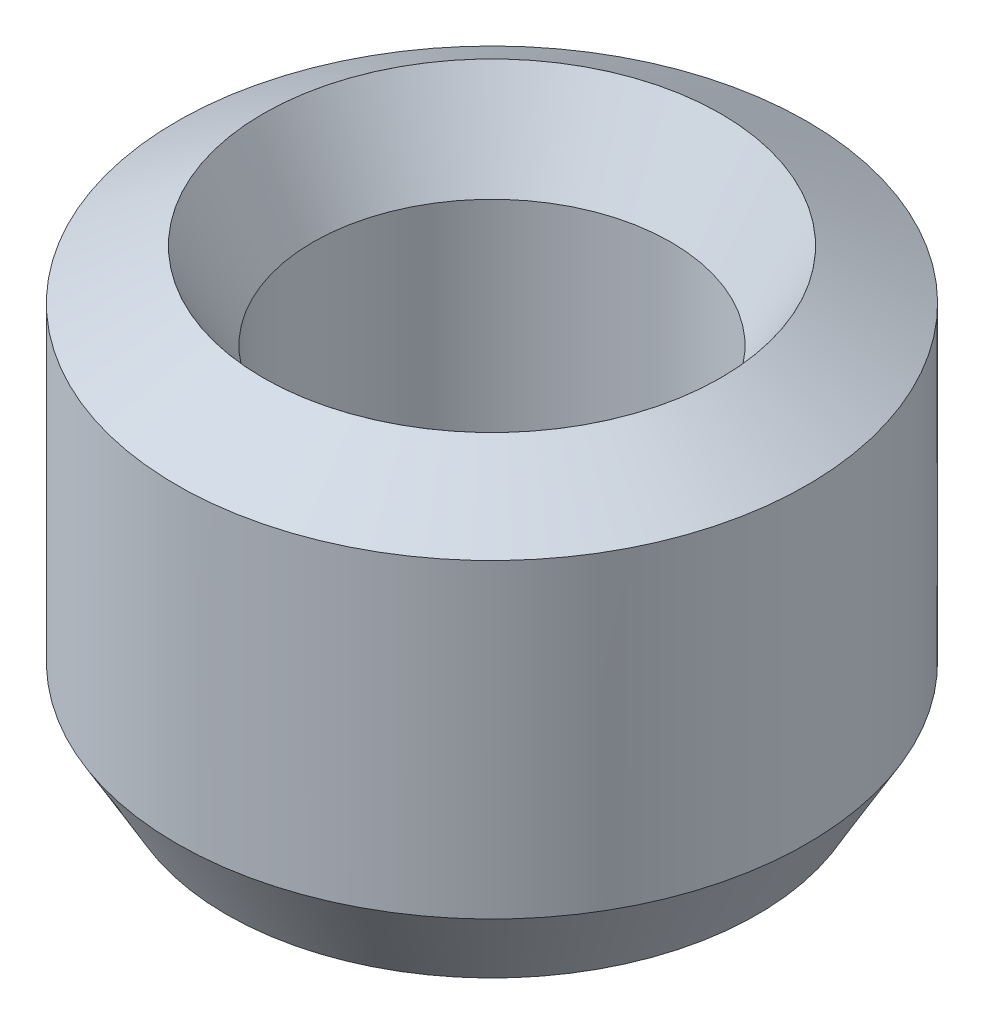
ISO-10303-21;
HEADER;
FILE_DESCRIPTION(('STEP AP214'),'2;1');
FILE_NAME('part.step','',(''),(''),'','','');
FILE_SCHEMA(('AUTOMOTIVE_DESIGN { 1 0 10303 214 1 1 1 1 }'));
ENDSEC;
DATA;
#1=APPLICATION_CONTEXT('core data for automotive mechanical design processes');
#2=APPLICATION_PROTOCOL_DEFINITION('international standard','automotive_design',2000,#1);
#3=PRODUCT_CONTEXT('',#1,'mechanical');
#4=PRODUCT('Part','Part','',(#3));
#5=PRODUCT_RELATED_PRODUCT_CATEGORY('part','',(#4));
#6=PRODUCT_DEFINITION_FORMATION('','',#4);
#7=PRODUCT_DEFINITION_CONTEXT('part definition',#1,'design');
#8=PRODUCT_DEFINITION('design','',#6,#7);
#9=PRODUCT_DEFINITION_SHAPE('','',#8);
#10=(LENGTH_UNIT() NAMED_UNIT(*) SI_UNIT(.MILLI.,.METRE.));
#11=(NAMED_UNIT(*) PLANE_ANGLE_UNIT() SI_UNIT($,.RADIAN.));
#12=(NAMED_UNIT(*) SI_UNIT($,.STERADIAN.) SOLID_ANGLE_UNIT());
#13=UNCERTAINTY_MEASURE_WITH_UNIT(LENGTH_MEASURE(1.E-05),#10,'distance_accuracy_value','');
#14=(GEOMETRIC_REPRESENTATION_CONTEXT(3) GLOBAL_UNCERTAINTY_ASSIGNED_CONTEXT((#13)) GLOBAL_UNIT_ASSIGNED_CONTEXT((#10,
#11,#12)) REPRESENTATION_CONTEXT('',''));
#15=CARTESIAN_POINT('',(0.,0.,0.));
#16=DIRECTION('',(0.,0.,1.));
#17=DIRECTION('',(1.,0.,0.));
#18=AXIS2_PLACEMENT_3D('',#15,#16,#17);
#19=CARTESIAN_POINT('',(0.,35.430724015313,0.));
#20=DIRECTION('',(0.,-1.,0.));
#21=DIRECTION('',(0.,0.,-1.));
#22=AXIS2_PLACEMENT_3D('',#19,#20,#21);
#23=CYLINDRICAL_SURFACE('',#22,25.);
#24=CARTESIAN_POINT('',(0.,6.84608260738762,0.));
#25=DIRECTION('',(0.,1.,0.));
#26=DIRECTION('',(0.,0.,1.));
#27=AXIS2_PLACEMENT_3D('',#24,#25,#26);
#28=CIRCLE('',#27,25.);
#29=CARTESIAN_POINT('',(0.,6.84608260738762,-25.));
#30=VERTEX_POINT('',#29);
#31=EDGE_CURVE('E10',#30,#30,#28,.T.);
#32=CARTESIAN_POINT('',(0.,31.4781363790434,0.));
#33=DIRECTION('',(0.,1.,0.));
#34=DIRECTION('',(0.,0.,1.));
#35=AXIS2_PLACEMENT_3D('',#32,#33,#34);
#36=CIRCLE('',#35,25.);
#37=CARTESIAN_POINT('',(0.,31.4781363790434,-25.));
#38=VERTEX_POINT('',#37);
#39=EDGE_CURVE('E50',#38,#38,#36,.F.);
#40=CARTESIAN_POINT('',(0.,6.84608260738762,-25.));
#41=CARTESIAN_POINT('',(0.,7.10266650084237,-25.));
#42=CARTESIAN_POINT('',(0.,7.35925039429711,-25.));
#43=CARTESIAN_POINT('',(0.,7.87241818120661,-25.));
#44=CARTESIAN_POINT('',(0.,8.12900207466136,-25.));
#45=CARTESIAN_POINT('',(0.,8.64216986157085,-25.));
#46=CARTESIAN_POINT('',(0.,8.8987537550256,-25.));
#47=CARTESIAN_POINT('',(0.,9.4119215419351,-25.));
#48=CARTESIAN_POINT('',(0.,9.66850543538984,-25.));
#49=CARTESIAN_POINT('',(0.,10.1816732222993,-25.));
#50=CARTESIAN_POINT('',(0.,10.4382571157541,-25.));
#51=CARTESIAN_POINT('',(0.,10.9514249026636,-25.));
#52=CARTESIAN_POINT('',(0.,11.2080087961183,-25.));
#53=CARTESIAN_POINT('',(0.,11.7211765830278,-25.));
#54=CARTESIAN_POINT('',(0.,11.9777604764826,-25.));
#55=CARTESIAN_POINT('',(0.,12.4909282633921,-25.));
#56=CARTESIAN_POINT('',(0.,12.7475121568468,-25.));
#57=CARTESIAN_POINT('',(0.,13.2606799437563,-25.));
#58=CARTESIAN_POINT('',(0.,13.5172638372111,-25.));
#59=CARTESIAN_POINT('',(0.,14.0304316241205,-25.));
#60=CARTESIAN_POINT('',(0.,14.2870155175753,-25.));
#61=CARTESIAN_POINT('',(0.,14.8001833044848,-25.));
#62=CARTESIAN_POINT('',(0.,15.0567671979395,-25.));
#63=CARTESIAN_POINT('',(0.,15.569934984849,-25.));
#64=CARTESIAN_POINT('',(0.,15.8265188783038,-25.));
#65=CARTESIAN_POINT('',(0.,16.3396866652133,-25.));
#66=CARTESIAN_POINT('',(0.,16.596270558668,-25.));
#67=CARTESIAN_POINT('',(0.,17.1094383455775,-25.));
#68=CARTESIAN_POINT('',(0.,17.3660222390323,-25.));
#69=CARTESIAN_POINT('',(0.,17.8791900259418,-25.));
#70=CARTESIAN_POINT('',(0.,18.1357739193965,-25.));
#71=CARTESIAN_POINT('',(0.,18.648941706306,-25.));
#72=CARTESIAN_POINT('',(0.,18.9055255997608,-25.));
#73=CARTESIAN_POINT('',(0.,19.4186933866702,-25.));
#74=CARTESIAN_POINT('',(0.,19.675277280125,-25.));
#75=CARTESIAN_POINT('',(0.,20.1884450670345,-25.));
#76=CARTESIAN_POINT('',(0.,20.4450289604892,-25.));
#77=CARTESIAN_POINT('',(0.,20.9581967473987,-25.));
#78=CARTESIAN_POINT('',(0.,21.2147806408535,-25.));
#79=CARTESIAN_POINT('',(0.,21.727948427763,-25.));
#80=CARTESIAN_POINT('',(0.,21.9845323212177,-25.));
#81=CARTESIAN_POINT('',(0.,22.4977001081272,-25.));
#82=CARTESIAN_POINT('',(0.,22.754284001582,-25.));
#83=CARTESIAN_POINT('',(0.,23.2674517884915,-25.));
#84=CARTESIAN_POINT('',(0.,23.5240356819462,-25.));
#85=CARTESIAN_POINT('',(0.,24.0372034688557,-25.));
#86=CARTESIAN_POINT('',(0.,24.2937873623104,-25.));
#87=CARTESIAN_POINT('',(0.,24.8069551492199,-25.));
#88=CARTESIAN_POINT('',(0.,25.0635390426747,-25.));
#89=CARTESIAN_POINT('',(0.,25.5767068295842,-25.));
#90=CARTESIAN_POINT('',(0.,25.8332907230389,-25.));
#91=CARTESIAN_POINT('',(0.,26.3464585099484,-25.));
#92=CARTESIAN_POINT('',(0.,26.6030424034032,-25.));
#93=CARTESIAN_POINT('',(0.,27.1162101903127,-25.));
#94=CARTESIAN_POINT('',(0.,27.3727940837674,-25.));
#95=CARTESIAN_POINT('',(0.,27.8859618706769,-25.));
#96=CARTESIAN_POINT('',(0.,28.1425457641317,-25.));
#97=CARTESIAN_POINT('',(0.,28.6557135510412,-25.));
#98=CARTESIAN_POINT('',(0.,28.9122974444959,-25.));
#99=CARTESIAN_POINT('',(0.,29.4254652314054,-25.));
#100=CARTESIAN_POINT('',(0.,29.6820491248601,-25.));
#101=CARTESIAN_POINT('',(0.,30.1952169117696,-25.));
#102=CARTESIAN_POINT('',(0.,30.4518008052244,-25.));
#103=CARTESIAN_POINT('',(0.,30.9649685921339,-25.));
#104=CARTESIAN_POINT('',(0.,31.2215524855886,-25.));
#105=CARTESIAN_POINT('',(0.,31.4781363790434,-25.));
#106=B_SPLINE_CURVE_WITH_KNOTS('',3,(#40,#41,#42,#43,#44,#45,#46,#47,#48,#49,#50,#51,#52,#53,
#54,#55,#56,#57,#58,#59,#60,#61,#62,#63,#64,#65,#66,#67,#68,#69,#70,#71,#72,#73,#74,#75,#76,#77,
#78,#79,#80,#81,#82,#83,#84,#85,#86,#87,#88,#89,#90,#91,#92,#93,#94,#95,#96,#97,#98,#99,#100,
#101,#102,#103,#104,#105),.UNSPECIFIED.,.F.,.F.,(4,2,2,2,2,2,2,2,2,2,2,2,2,2,2,2,2,2,2,2,2,2,2,
2,2,2,2,2,2,2,2,2,4),(0.,0.769751680364243,1.53950336072849,2.30925504109273,3.07900672145697,
3.84875840182121,4.61851008218546,5.3882617625497,6.15801344291394,6.92776512327818,
7.69751680364242,8.46726848400667,9.23702016437091,10.0067718447352,10.7765235250994,
11.5462752054636,12.3160268858279,13.0857785661921,13.8555302465564,14.6252819269206,
15.3950336072848,16.1647852876491,16.9345369680133,17.7042886483776,18.4740403287418,
19.2437920091061,20.0135436894703,20.7832953698345,21.5530470501988,22.322798730563,
23.0925504109273,23.8623020912915,24.6320537716558),.UNSPECIFIED.);
#107=EDGE_CURVE('BSEAM39',#30,#38,#106,.T.);
#108=ORIENTED_EDGE('',*,*,#31,.T.);
#109=ORIENTED_EDGE('',*,*,#39,.T.);
#110=ORIENTED_EDGE('',*,*,#107,.T.);
#111=ORIENTED_EDGE('',*,*,#107,.F.);
#112=EDGE_LOOP('',(#108,#110,#109,#111));
#113=FACE_BOUND('',#112,.T.);
#114=ADVANCED_FACE('F39',(#113),#23,.T.);
#115=CARTESIAN_POINT('',(0.,35.430724015313,0.));
#116=DIRECTION('',(0.,1.,0.));
#117=DIRECTION('',(0.,0.,1.));
#118=AXIS2_PLACEMENT_3D('',#115,#116,#117);
#119=PLANE('',#118);
#120=CARTESIAN_POINT('',(0.,35.430724015313,0.));
#121=DIRECTION('',(0.,1.,0.));
#122=DIRECTION('',(0.,0.,1.));
#123=AXIS2_PLACEMENT_3D('',#120,#121,#122);
#124=CIRCLE('',#123,18.1517224325015);
#125=CARTESIAN_POINT('',(0.,35.430724015313,18.1517224325015));
#126=VERTEX_POINT('',#125);
#127=EDGE_CURVE('E58',#126,#126,#124,.F.);
#128=ORIENTED_EDGE('',*,*,#127,.T.);
#129=EDGE_LOOP('',(#128));
#130=FACE_BOUND('',#129,.T.);
#131=CARTESIAN_POINT('',(0.,35.430724015313,0.));
#132=DIRECTION('',(0.,1.,0.));
#133=DIRECTION('',(0.,0.,1.));
#134=AXIS2_PLACEMENT_3D('',#131,#132,#133);
#135=CIRCLE('',#134,18.1539173926125);
#136=CARTESIAN_POINT('',(0.,35.430724015313,18.1539173926125));
#137=VERTEX_POINT('',#136);
#138=EDGE_CURVE('E61',#137,#137,#135,.T.);
#139=ORIENTED_EDGE('',*,*,#138,.T.);
#140=EDGE_LOOP('',(#139));
#141=FACE_BOUND('',#140,.T.);
#142=ADVANCED_FACE('F88',(#130,#141),#119,.T.);
#143=CARTESIAN_POINT('',(0.,0.,0.));
#144=DIRECTION('',(0.,1.,0.));
#145=DIRECTION('',(0.,0.,1.));
#146=AXIS2_PLACEMENT_3D('',#143,#144,#145);
#147=PLANE('',#146);
#148=CARTESIAN_POINT('',(0.,0.,0.));
#149=DIRECTION('',(0.,1.,0.));
#150=DIRECTION('',(0.,0.,1.));
#151=AXIS2_PLACEMENT_3D('',#148,#149,#150);
#152=CIRCLE('',#151,21.0452174036193);
#153=CARTESIAN_POINT('',(0.,0.,21.0452174036193));
#154=VERTEX_POINT('',#153);
#155=EDGE_CURVE('E51',#154,#154,#152,.T.);
#156=ORIENTED_EDGE('',*,*,#155,.T.);
#157=EDGE_LOOP('',(#156));
#158=FACE_BOUND('',#157,.T.);
#159=CARTESIAN_POINT('',(0.,0.,0.));
#160=DIRECTION('',(0.,1.,0.));
#161=DIRECTION('',(0.,0.,1.));
#162=AXIS2_PLACEMENT_3D('',#159,#160,#161);
#163=CIRCLE('',#162,21.0474123637303);
#164=CARTESIAN_POINT('',(0.,0.,21.0474123637303));
#165=VERTEX_POINT('',#164);
#166=EDGE_CURVE('E54',#165,#165,#163,.F.);
#167=ORIENTED_EDGE('',*,*,#166,.T.);
#168=EDGE_LOOP('',(#167));
#169=FACE_BOUND('',#168,.T.);
#170=ADVANCED_FACE('F83',(#158,#169),#147,.F.);
#171=CARTESIAN_POINT('',(0.,35.430724015313,0.));
#172=DIRECTION('',(0.,-1.,0.));
#173=DIRECTION('',(0.,0.,-1.));
#174=AXIS2_PLACEMENT_3D('',#171,#172,#173);
#175=CYLINDRICAL_SURFACE('',#174,14.1991347962318);
#176=CARTESIAN_POINT('',(0.,28.5846414079254,0.));
#177=DIRECTION('',(0.,1.,0.));
#178=DIRECTION('',(0.,0.,1.));
#179=AXIS2_PLACEMENT_3D('',#176,#177,#178);
#180=CIRCLE('',#179,14.1991347962318);
#181=CARTESIAN_POINT('',(0.,28.5846414079254,-14.1991347962318));
#182=VERTEX_POINT('',#181);
#183=EDGE_CURVE('E67',#182,#182,#180,.T.);
#184=CARTESIAN_POINT('',(0.,3.95258763626964,0.));
#185=DIRECTION('',(0.,1.,0.));
#186=DIRECTION('',(0.,0.,1.));
#187=AXIS2_PLACEMENT_3D('',#184,#185,#186);
#188=CIRCLE('',#187,14.1991347962318);
#189=CARTESIAN_POINT('',(0.,3.95258763626964,-14.1991347962318));
#190=VERTEX_POINT('',#189);
#191=EDGE_CURVE('E69',#190,#190,#188,.F.);
#192=CARTESIAN_POINT('',(0.,28.5846414079254,-14.1991347962318));
#193=CARTESIAN_POINT('',(0.,28.3280575144706,-14.1991347962318));
#194=CARTESIAN_POINT('',(0.,28.0714736210159,-14.1991347962318));
#195=CARTESIAN_POINT('',(0.,27.5583058341064,-14.1991347962318));
#196=CARTESIAN_POINT('',(0.,27.3017219406516,-14.1991347962318));
#197=CARTESIAN_POINT('',(0.,26.7885541537421,-14.1991347962318));
#198=CARTESIAN_POINT('',(0.,26.5319702602874,-14.1991347962318));
#199=CARTESIAN_POINT('',(0.,26.0188024733779,-14.1991347962318));
#200=CARTESIAN_POINT('',(0.,25.7622185799231,-14.1991347962318));
#201=CARTESIAN_POINT('',(0.,25.2490507930137,-14.1991347962318));
#202=CARTESIAN_POINT('',(0.,24.9924668995589,-14.1991347962318));
#203=CARTESIAN_POINT('',(0.,24.4792991126494,-14.1991347962318));
#204=CARTESIAN_POINT('',(0.,24.2227152191947,-14.1991347962318));
#205=CARTESIAN_POINT('',(0.,23.7095474322852,-14.1991347962318));
#206=CARTESIAN_POINT('',(0.,23.4529635388304,-14.1991347962318));
#207=CARTESIAN_POINT('',(0.,22.9397957519209,-14.1991347962318));
#208=CARTESIAN_POINT('',(0.,22.6832118584662,-14.1991347962318));
#209=CARTESIAN_POINT('',(0.,22.1700440715567,-14.1991347962318));
#210=CARTESIAN_POINT('',(0.,21.9134601781019,-14.1991347962318));
#211=CARTESIAN_POINT('',(0.,21.4002923911924,-14.1991347962318));
#212=CARTESIAN_POINT('',(0.,21.1437084977377,-14.1991347962318));
#213=CARTESIAN_POINT('',(0.,20.6305407108282,-14.1991347962318));
#214=CARTESIAN_POINT('',(0.,20.3739568173735,-14.1991347962318));
#215=CARTESIAN_POINT('',(0.,19.860789030464,-14.1991347962318));
#216=CARTESIAN_POINT('',(0.,19.6042051370092,-14.1991347962318));
#217=CARTESIAN_POINT('',(0.,19.0910373500997,-14.1991347962318));
#218=CARTESIAN_POINT('',(0.,18.834453456645,-14.1991347962318));
#219=CARTESIAN_POINT('',(0.,18.3212856697355,-14.1991347962318));
#220=CARTESIAN_POINT('',(0.,18.0647017762807,-14.1991347962318));
#221=CARTESIAN_POINT('',(0.,17.5515339893712,-14.1991347962318));
#222=CARTESIAN_POINT('',(0.,17.2949500959165,-14.1991347962318));
#223=CARTESIAN_POINT('',(0.,16.781782309007,-14.1991347962318));
#224=CARTESIAN_POINT('',(0.,16.5251984155522,-14.1991347962318));
#225=CARTESIAN_POINT('',(0.,16.0120306286428,-14.1991347962318));
#226=CARTESIAN_POINT('',(0.,15.755446735188,-14.1991347962318));
#227=CARTESIAN_POINT('',(0.,15.2422789482785,-14.1991347962318));
#228=CARTESIAN_POINT('',(0.,14.9856950548238,-14.1991347962318));
#229=CARTESIAN_POINT('',(0.,14.4725272679143,-14.1991347962318));
#230=CARTESIAN_POINT('',(0.,14.2159433744595,-14.1991347962318));
#231=CARTESIAN_POINT('',(0.,13.70277558755,-14.1991347962318));
#232=CARTESIAN_POINT('',(0.,13.4461916940953,-14.1991347962318));
#233=CARTESIAN_POINT('',(0.,12.9330239071858,-14.1991347962318));
#234=CARTESIAN_POINT('',(0.,12.676440013731,-14.1991347962318));
#235=CARTESIAN_POINT('',(0.,12.1632722268215,-14.1991347962318));
#236=CARTESIAN_POINT('',(0.,11.9066883333668,-14.1991347962318));
#237=CARTESIAN_POINT('',(0.,11.3935205464573,-14.1991347962318));
#238=CARTESIAN_POINT('',(0.,11.1369366530026,-14.1991347962318));
#239=CARTESIAN_POINT('',(0.,10.6237688660931,-14.1991347962318));
#240=CARTESIAN_POINT('',(0.,10.3671849726383,-14.1991347962318));
#241=CARTESIAN_POINT('',(0.,9.85401718572882,-14.1991347962318));
#242=CARTESIAN_POINT('',(0.,9.59743329227408,-14.1991347962318));
#243=CARTESIAN_POINT('',(0.,9.08426550536458,-14.1991347962318));
#244=CARTESIAN_POINT('',(0.,8.82768161190983,-14.1991347962318));
#245=CARTESIAN_POINT('',(0.,8.31451382500034,-14.1991347962318));
#246=CARTESIAN_POINT('',(0.,8.05792993154559,-14.1991347962318));
#247=CARTESIAN_POINT('',(0.,7.5447621446361,-14.1991347962318));
#248=CARTESIAN_POINT('',(0.,7.28817825118135,-14.1991347962318));
#249=CARTESIAN_POINT('',(0.,6.77501046427186,-14.1991347962318));
#250=CARTESIAN_POINT('',(0.,6.51842657081711,-14.1991347962318));
#251=CARTESIAN_POINT('',(0.,6.00525878390762,-14.1991347962318));
#252=CARTESIAN_POINT('',(0.,5.74867489045287,-14.1991347962318));
#253=CARTESIAN_POINT('',(0.,5.23550710354337,-14.1991347962318));
#254=CARTESIAN_POINT('',(0.,4.97892321008863,-14.1991347962318));
#255=CARTESIAN_POINT('',(0.,4.46575542317913,-14.1991347962318));
#256=CARTESIAN_POINT('',(0.,4.20917152972439,-14.1991347962318));
#257=CARTESIAN_POINT('',(0.,3.95258763626964,-14.1991347962318));
#258=B_SPLINE_CURVE_WITH_KNOTS('',3,(#192,#193,#194,#195,#196,#197,#198,#199,#200,#201,#202,
#203,#204,#205,#206,#207,#208,#209,#210,#211,#212,#213,#214,#215,#216,#217,#218,#219,#220,#221,
#222,#223,#224,#225,#226,#227,#228,#229,#230,#231,#232,#233,#234,#235,#236,#237,#238,#239,#240,
#241,#242,#243,#244,#245,#246,#247,#248,#249,#250,#251,#252,#253,#254,#255,#256,#257),
.UNSPECIFIED.,.F.,.F.,(4,2,2,2,2,2,2,2,2,2,2,2,2,2,2,2,2,2,2,2,2,2,2,2,2,2,2,2,2,2,2,2,4),(0.,
0.76975168036424,1.53950336072848,2.30925504109272,3.07900672145696,3.84875840182121,
4.61851008218545,5.38826176254969,6.15801344291393,6.92776512327817,7.69751680364241,
8.46726848400666,9.2370201643709,10.0067718447351,10.7765235250994,11.5462752054636,
12.3160268858279,13.0857785661921,13.8555302465563,14.6252819269206,15.3950336072848,
16.1647852876491,16.9345369680133,17.7042886483776,18.4740403287418,19.243792009106,
20.0135436894703,20.7832953698345,21.5530470501988,22.322798730563,23.0925504109272,
23.8623020912915,24.6320537716557),.UNSPECIFIED.);
#259=EDGE_CURVE('BSEAM71',#182,#190,#258,.T.);
#260=ORIENTED_EDGE('',*,*,#183,.T.);
#261=ORIENTED_EDGE('',*,*,#191,.T.);
#262=ORIENTED_EDGE('',*,*,#259,.T.);
#263=ORIENTED_EDGE('',*,*,#259,.F.);
#264=EDGE_LOOP('',(#260,#262,#261,#263));
#265=FACE_BOUND('',#264,.T.);
#266=ADVANCED_FACE('F71',(#265),#175,.F.);
#267=CARTESIAN_POINT('',(0.,28.5846414079254,0.));
#268=DIRECTION('',(0.,1.,0.));
#269=DIRECTION('',(0.,0.,1.));
#270=AXIS2_PLACEMENT_3D('',#267,#268,#269);
#271=CONICAL_SURFACE('',#270,14.1991347962318,0.523598775598303);
#272=ORIENTED_EDGE('',*,*,#127,.F.);
#273=EDGE_LOOP('',(#272));
#274=FACE_BOUND('',#273,.T.);
#275=ORIENTED_EDGE('',*,*,#183,.F.);
#276=EDGE_LOOP('',(#275));
#277=FACE_BOUND('',#276,.T.);
#278=ADVANCED_FACE('F77',(#274,#277),#271,.F.);
#279=CARTESIAN_POINT('',(0.,0.,0.));
#280=DIRECTION('',(0.,-1.,0.));
#281=DIRECTION('',(0.,0.,-1.));
#282=AXIS2_PLACEMENT_3D('',#279,#280,#281);
#283=CONICAL_SURFACE('',#282,21.0452174036193,1.04719755119659);
#284=ORIENTED_EDGE('',*,*,#191,.F.);
#285=EDGE_LOOP('',(#284));
#286=FACE_BOUND('',#285,.T.);
#287=ORIENTED_EDGE('',*,*,#155,.F.);
#288=EDGE_LOOP('',(#287));
#289=FACE_BOUND('',#288,.T.);
#290=ADVANCED_FACE('F73',(#286,#289),#283,.F.);
#291=CARTESIAN_POINT('',(0.,6.84608260738762,0.));
#292=DIRECTION('',(0.,1.,0.));
#293=DIRECTION('',(0.,0.,1.));
#294=AXIS2_PLACEMENT_3D('',#291,#292,#293);
#295=CONICAL_SURFACE('',#294,25.,0.523598775598303);
#296=ORIENTED_EDGE('',*,*,#166,.F.);
#297=EDGE_LOOP('',(#296));
#298=FACE_BOUND('',#297,.T.);
#299=ORIENTED_EDGE('',*,*,#31,.F.);
#300=EDGE_LOOP('',(#299));
#301=FACE_BOUND('',#300,.T.);
#302=ADVANCED_FACE('F76',(#298,#301),#295,.T.);
#303=CARTESIAN_POINT('',(0.,35.430724015313,0.));
#304=DIRECTION('',(0.,-1.,0.));
#305=DIRECTION('',(0.,0.,-1.));
#306=AXIS2_PLACEMENT_3D('',#303,#304,#305);
#307=CONICAL_SURFACE('',#306,18.1539173926125,1.04719755119659);
#308=ORIENTED_EDGE('',*,*,#39,.F.);
#309=EDGE_LOOP('',(#308));
#310=FACE_BOUND('',#309,.T.);
#311=ORIENTED_EDGE('',*,*,#138,.F.);
#312=EDGE_LOOP('',(#311));
#313=FACE_BOUND('',#312,.T.);
#314=ADVANCED_FACE('F45',(#310,#313),#307,.T.);
#315=CLOSED_SHELL('',(#114,#142,#170,#266,#278,#290,#302,#314));
#316=MANIFOLD_SOLID_BREP('B2',#315);
#317=ADVANCED_BREP_SHAPE_REPRESENTATION('',(#18,#316),#14);
#318=SHAPE_DEFINITION_REPRESENTATION(#9,#317);
ENDSEC;
END-ISO-10303-21;
